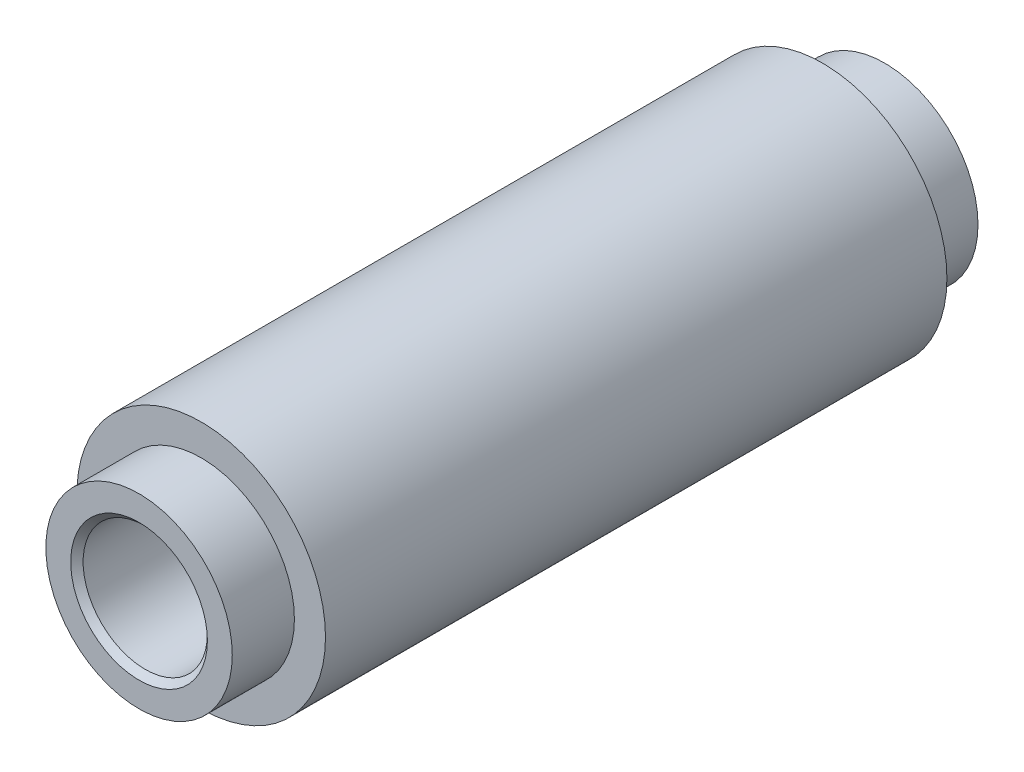
ISO-10303-21;
HEADER;
FILE_DESCRIPTION(('STEP AP214'),'2;1');
FILE_NAME('part.step','',(''),(''),'','','');
FILE_SCHEMA(('AUTOMOTIVE_DESIGN { 1 0 10303 214 1 1 1 1 }'));
ENDSEC;
DATA;
#1=APPLICATION_CONTEXT('core data for automotive mechanical design processes');
#2=APPLICATION_PROTOCOL_DEFINITION('international standard','automotive_design',2000,#1);
#3=PRODUCT_CONTEXT('',#1,'mechanical');
#4=PRODUCT('Part','Part','',(#3));
#5=PRODUCT_RELATED_PRODUCT_CATEGORY('part','',(#4));
#6=PRODUCT_DEFINITION_FORMATION('','',#4);
#7=PRODUCT_DEFINITION_CONTEXT('part definition',#1,'design');
#8=PRODUCT_DEFINITION('design','',#6,#7);
#9=PRODUCT_DEFINITION_SHAPE('','',#8);
#10=(LENGTH_UNIT() NAMED_UNIT(*) SI_UNIT(.MILLI.,.METRE.));
#11=(NAMED_UNIT(*) PLANE_ANGLE_UNIT() SI_UNIT($,.RADIAN.));
#12=(NAMED_UNIT(*) SI_UNIT($,.STERADIAN.) SOLID_ANGLE_UNIT());
#13=UNCERTAINTY_MEASURE_WITH_UNIT(LENGTH_MEASURE(1.E-05),#10,'distance_accuracy_value','');
#14=(GEOMETRIC_REPRESENTATION_CONTEXT(3) GLOBAL_UNCERTAINTY_ASSIGNED_CONTEXT((#13)) GLOBAL_UNIT_ASSIGNED_CONTEXT((#10,
#11,#12)) REPRESENTATION_CONTEXT('',''));
#15=CARTESIAN_POINT('',(0.,0.,0.));
#16=DIRECTION('',(0.,0.,1.));
#17=DIRECTION('',(1.,0.,0.));
#18=AXIS2_PLACEMENT_3D('',#15,#16,#17);
#19=CARTESIAN_POINT('',(0.,0.,10.));
#20=DIRECTION('',(0.,0.,-1.));
#21=DIRECTION('',(-1.,0.,0.));
#22=AXIS2_PLACEMENT_3D('',#19,#20,#21);
#23=CYLINDRICAL_SURFACE('',#22,4.);
#24=CARTESIAN_POINT('',(0.,0.,10.));
#25=DIRECTION('',(0.,0.,1.));
#26=DIRECTION('',(1.,0.,0.));
#27=AXIS2_PLACEMENT_3D('',#24,#25,#26);
#28=CIRCLE('',#27,4.);
#29=CARTESIAN_POINT('',(4.,0.,10.));
#30=VERTEX_POINT('',#29);
#31=EDGE_CURVE('E57',#30,#30,#28,.T.);
#32=ORIENTED_EDGE('',*,*,#31,.F.);
#33=EDGE_LOOP('',(#32));
#34=FACE_BOUND('',#33,.T.);
#35=CARTESIAN_POINT('',(0.,0.,-10.));
#36=DIRECTION('',(0.,0.,1.));
#37=DIRECTION('',(1.,0.,0.));
#38=AXIS2_PLACEMENT_3D('',#35,#36,#37);
#39=CIRCLE('',#38,4.);
#40=CARTESIAN_POINT('',(4.,0.,-10.));
#41=VERTEX_POINT('',#40);
#42=EDGE_CURVE('E65',#41,#41,#39,.T.);
#43=ORIENTED_EDGE('',*,*,#42,.T.);
#44=EDGE_LOOP('',(#43));
#45=FACE_BOUND('',#44,.T.);
#46=ADVANCED_FACE('F36',(#34,#45),#23,.T.);
#47=CARTESIAN_POINT('',(0.,0.,10.));
#48=DIRECTION('',(0.,0.,1.));
#49=DIRECTION('',(1.,0.,0.));
#50=AXIS2_PLACEMENT_3D('',#47,#48,#49);
#51=PLANE('',#50);
#52=CARTESIAN_POINT('',(0.,0.,10.));
#53=DIRECTION('',(0.,0.,1.));
#54=DIRECTION('',(1.,0.,0.));
#55=AXIS2_PLACEMENT_3D('',#52,#53,#54);
#56=CIRCLE('',#55,3.);
#57=CARTESIAN_POINT('',(3.,0.,10.));
#58=VERTEX_POINT('',#57);
#59=EDGE_CURVE('E56',#58,#58,#56,.T.);
#60=ORIENTED_EDGE('',*,*,#59,.F.);
#61=EDGE_LOOP('',(#60));
#62=FACE_BOUND('',#61,.T.);
#63=ORIENTED_EDGE('',*,*,#31,.T.);
#64=EDGE_LOOP('',(#63));
#65=FACE_BOUND('',#64,.T.);
#66=ADVANCED_FACE('F92',(#62,#65),#51,.T.);
#67=CARTESIAN_POINT('',(0.,0.,12.));
#68=DIRECTION('',(0.,0.,-1.));
#69=DIRECTION('',(-1.,0.,0.));
#70=AXIS2_PLACEMENT_3D('',#67,#68,#69);
#71=CYLINDRICAL_SURFACE('',#70,3.);
#72=CARTESIAN_POINT('',(0.,0.,12.));
#73=DIRECTION('',(0.,0.,1.));
#74=DIRECTION('',(1.,0.,0.));
#75=AXIS2_PLACEMENT_3D('',#72,#73,#74);
#76=CIRCLE('',#75,3.);
#77=CARTESIAN_POINT('',(3.,0.,12.));
#78=VERTEX_POINT('',#77);
#79=EDGE_CURVE('E60',#78,#78,#76,.T.);
#80=ORIENTED_EDGE('',*,*,#79,.F.);
#81=EDGE_LOOP('',(#80));
#82=FACE_BOUND('',#81,.T.);
#83=ORIENTED_EDGE('',*,*,#59,.T.);
#84=EDGE_LOOP('',(#83));
#85=FACE_BOUND('',#84,.T.);
#86=ADVANCED_FACE('F98',(#82,#85),#71,.T.);
#87=CARTESIAN_POINT('',(0.,0.,12.));
#88=DIRECTION('',(0.,0.,1.));
#89=DIRECTION('',(1.,0.,0.));
#90=AXIS2_PLACEMENT_3D('',#87,#88,#89);
#91=PLANE('',#90);
#92=CARTESIAN_POINT('',(0.,0.,12.));
#93=DIRECTION('',(0.,0.,1.));
#94=DIRECTION('',(1.,0.,0.));
#95=AXIS2_PLACEMENT_3D('',#92,#93,#94);
#96=CIRCLE('',#95,2.2);
#97=CARTESIAN_POINT('',(2.2,0.,12.));
#98=VERTEX_POINT('',#97);
#99=EDGE_CURVE('E10',#98,#98,#96,.F.);
#100=ORIENTED_EDGE('',*,*,#99,.T.);
#101=EDGE_LOOP('',(#100));
#102=FACE_BOUND('',#101,.T.);
#103=ORIENTED_EDGE('',*,*,#79,.T.);
#104=EDGE_LOOP('',(#103));
#105=FACE_BOUND('',#104,.T.);
#106=ADVANCED_FACE('F139',(#102,#105),#91,.T.);
#107=CARTESIAN_POINT('',(0.,0.,-10.));
#108=DIRECTION('',(0.,0.,-1.));
#109=DIRECTION('',(1.,0.,0.));
#110=AXIS2_PLACEMENT_3D('',#107,#108,#109);
#111=PLANE('',#110);
#112=CARTESIAN_POINT('',(0.,0.,-10.));
#113=DIRECTION('',(0.,0.,1.));
#114=DIRECTION('',(1.,0.,0.));
#115=AXIS2_PLACEMENT_3D('',#112,#113,#114);
#116=CIRCLE('',#115,3.);
#117=CARTESIAN_POINT('',(3.,0.,-10.));
#118=VERTEX_POINT('',#117);
#119=EDGE_CURVE('E69',#118,#118,#116,.T.);
#120=ORIENTED_EDGE('',*,*,#119,.T.);
#121=EDGE_LOOP('',(#120));
#122=FACE_BOUND('',#121,.T.);
#123=ORIENTED_EDGE('',*,*,#42,.F.);
#124=EDGE_LOOP('',(#123));
#125=FACE_BOUND('',#124,.T.);
#126=ADVANCED_FACE('F89',(#122,#125),#111,.T.);
#127=CARTESIAN_POINT('',(0.,0.,-12.));
#128=DIRECTION('',(0.,0.,1.));
#129=DIRECTION('',(1.,0.,0.));
#130=AXIS2_PLACEMENT_3D('',#127,#128,#129);
#131=CYLINDRICAL_SURFACE('',#130,3.);
#132=CARTESIAN_POINT('',(0.,0.,-12.));
#133=DIRECTION('',(0.,0.,1.));
#134=DIRECTION('',(1.,0.,0.));
#135=AXIS2_PLACEMENT_3D('',#132,#133,#134);
#136=CIRCLE('',#135,3.);
#137=CARTESIAN_POINT('',(3.,0.,-12.));
#138=VERTEX_POINT('',#137);
#139=EDGE_CURVE('E68',#138,#138,#136,.T.);
#140=ORIENTED_EDGE('',*,*,#139,.T.);
#141=EDGE_LOOP('',(#140));
#142=FACE_BOUND('',#141,.T.);
#143=ORIENTED_EDGE('',*,*,#119,.F.);
#144=EDGE_LOOP('',(#143));
#145=FACE_BOUND('',#144,.T.);
#146=ADVANCED_FACE('F75',(#142,#145),#131,.T.);
#147=CARTESIAN_POINT('',(0.,0.,-12.));
#148=DIRECTION('',(0.,0.,-1.));
#149=DIRECTION('',(1.,0.,0.));
#150=AXIS2_PLACEMENT_3D('',#147,#148,#149);
#151=PLANE('',#150);
#152=CARTESIAN_POINT('',(0.,0.,-12.));
#153=DIRECTION('',(0.,0.,-1.));
#154=DIRECTION('',(-1.,0.,0.));
#155=AXIS2_PLACEMENT_3D('',#152,#153,#154);
#156=CIRCLE('',#155,2.2);
#157=CARTESIAN_POINT('',(-2.2,0.,-12.));
#158=VERTEX_POINT('',#157);
#159=EDGE_CURVE('E51',#158,#158,#156,.F.);
#160=ORIENTED_EDGE('',*,*,#159,.T.);
#161=EDGE_LOOP('',(#160));
#162=FACE_BOUND('',#161,.T.);
#163=ORIENTED_EDGE('',*,*,#139,.F.);
#164=EDGE_LOOP('',(#163));
#165=FACE_BOUND('',#164,.T.);
#166=ADVANCED_FACE('F78',(#162,#165),#151,.T.);
#167=CARTESIAN_POINT('',(0.,0.,-12.));
#168=DIRECTION('',(0.,0.,1.));
#169=DIRECTION('',(1.,0.,0.));
#170=AXIS2_PLACEMENT_3D('',#167,#168,#169);
#171=CYLINDRICAL_SURFACE('',#170,2.);
#172=CARTESIAN_POINT('',(0.,0.,-11.8));
#173=DIRECTION('',(0.,0.,-1.));
#174=DIRECTION('',(-1.,0.,0.));
#175=AXIS2_PLACEMENT_3D('',#172,#173,#174);
#176=CIRCLE('',#175,2.);
#177=CARTESIAN_POINT('',(-2.,0.,-11.8));
#178=VERTEX_POINT('',#177);
#179=EDGE_CURVE('E43',#178,#178,#176,.T.);
#180=ORIENTED_EDGE('',*,*,#179,.T.);
#181=EDGE_LOOP('',(#180));
#182=FACE_BOUND('',#181,.T.);
#183=CARTESIAN_POINT('',(0.,0.,11.8));
#184=DIRECTION('',(0.,0.,1.));
#185=DIRECTION('',(1.,0.,0.));
#186=AXIS2_PLACEMENT_3D('',#183,#184,#185);
#187=CIRCLE('',#186,2.);
#188=CARTESIAN_POINT('',(2.,0.,11.8));
#189=VERTEX_POINT('',#188);
#190=EDGE_CURVE('E47',#189,#189,#187,.T.);
#191=ORIENTED_EDGE('',*,*,#190,.T.);
#192=EDGE_LOOP('',(#191));
#193=FACE_BOUND('',#192,.T.);
#194=ADVANCED_FACE('F80',(#182,#193),#171,.F.);
#195=CARTESIAN_POINT('',(0.,0.,-12.));
#196=DIRECTION('',(0.,0.,-1.));
#197=DIRECTION('',(-1.,0.,0.));
#198=AXIS2_PLACEMENT_3D('',#195,#196,#197);
#199=CONICAL_SURFACE('',#198,2.2,0.785398163397448);
#200=ORIENTED_EDGE('',*,*,#179,.F.);
#201=EDGE_LOOP('',(#200));
#202=FACE_BOUND('',#201,.T.);
#203=ORIENTED_EDGE('',*,*,#159,.F.);
#204=EDGE_LOOP('',(#203));
#205=FACE_BOUND('',#204,.T.);
#206=ADVANCED_FACE('F87',(#202,#205),#199,.F.);
#207=CARTESIAN_POINT('',(0.,0.,11.8));
#208=DIRECTION('',(0.,0.,1.));
#209=DIRECTION('',(1.,0.,0.));
#210=AXIS2_PLACEMENT_3D('',#207,#208,#209);
#211=CONICAL_SURFACE('',#210,2.,0.785398163397444);
#212=ORIENTED_EDGE('',*,*,#99,.F.);
#213=EDGE_LOOP('',(#212));
#214=FACE_BOUND('',#213,.T.);
#215=ORIENTED_EDGE('',*,*,#190,.F.);
#216=EDGE_LOOP('',(#215));
#217=FACE_BOUND('',#216,.T.);
#218=ADVANCED_FACE('F38',(#214,#217),#211,.F.);
#219=CLOSED_SHELL('',(#46,#66,#86,#106,#126,#146,#166,#194,#206,#218));
#220=MANIFOLD_SOLID_BREP('B2',#219);
#221=ADVANCED_BREP_SHAPE_REPRESENTATION('',(#18,#220),#14);
#222=SHAPE_DEFINITION_REPRESENTATION(#9,#221);
ENDSEC;
END-ISO-10303-21;
